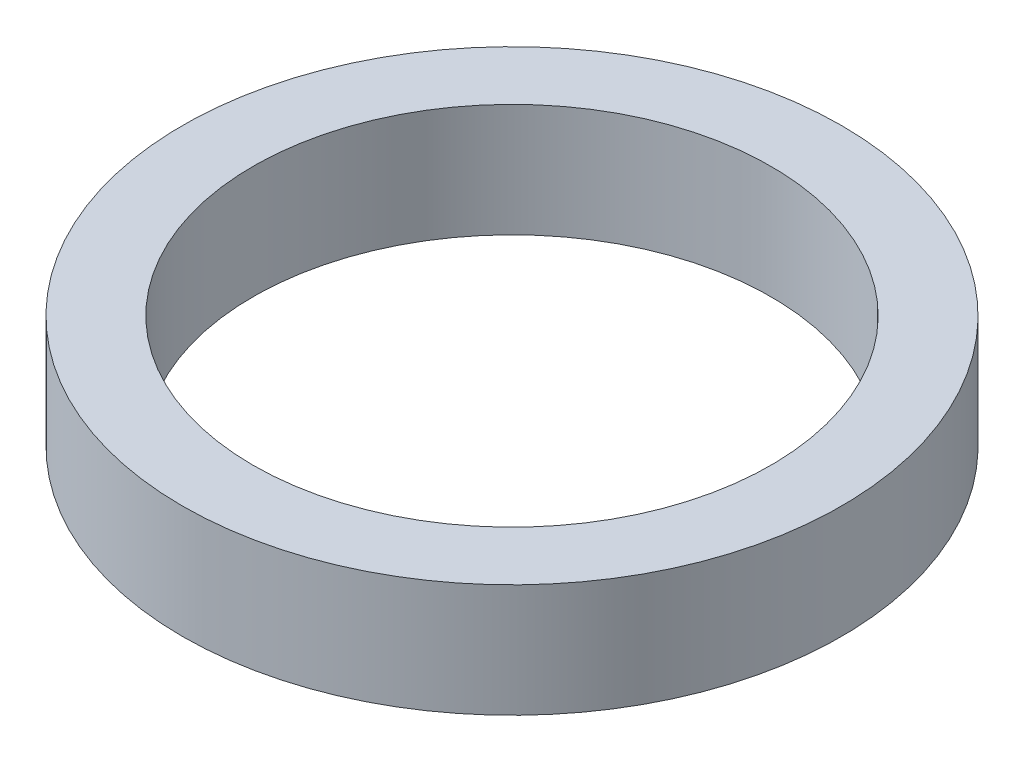
ISO-10303-21;
HEADER;
FILE_DESCRIPTION(('STEP AP214'),'2;1');
FILE_NAME('part.step','',(''),(''),'','','');
FILE_SCHEMA(('AUTOMOTIVE_DESIGN { 1 0 10303 214 1 1 1 1 }'));
ENDSEC;
DATA;
#1=APPLICATION_CONTEXT('core data for automotive mechanical design processes');
#2=APPLICATION_PROTOCOL_DEFINITION('international standard','automotive_design',2000,#1);
#3=PRODUCT_CONTEXT('',#1,'mechanical');
#4=PRODUCT('Part','Part','',(#3));
#5=PRODUCT_RELATED_PRODUCT_CATEGORY('part','',(#4));
#6=PRODUCT_DEFINITION_FORMATION('','',#4);
#7=PRODUCT_DEFINITION_CONTEXT('part definition',#1,'design');
#8=PRODUCT_DEFINITION('design','',#6,#7);
#9=PRODUCT_DEFINITION_SHAPE('','',#8);
#10=(LENGTH_UNIT() NAMED_UNIT(*) SI_UNIT(.MILLI.,.METRE.));
#11=(NAMED_UNIT(*) PLANE_ANGLE_UNIT() SI_UNIT($,.RADIAN.));
#12=(NAMED_UNIT(*) SI_UNIT($,.STERADIAN.) SOLID_ANGLE_UNIT());
#13=UNCERTAINTY_MEASURE_WITH_UNIT(LENGTH_MEASURE(1.E-05),#10,'distance_accuracy_value','');
#14=(GEOMETRIC_REPRESENTATION_CONTEXT(3) GLOBAL_UNCERTAINTY_ASSIGNED_CONTEXT((#13)) GLOBAL_UNIT_ASSIGNED_CONTEXT((#10,
#11,#12)) REPRESENTATION_CONTEXT('',''));
#15=CARTESIAN_POINT('',(0.,0.,0.));
#16=DIRECTION('',(0.,0.,1.));
#17=DIRECTION('',(1.,0.,0.));
#18=AXIS2_PLACEMENT_3D('',#15,#16,#17);
#19=CARTESIAN_POINT('',(0.,12.,0.));
#20=DIRECTION('',(0.,-1.,0.));
#21=DIRECTION('',(0.,0.,-1.));
#22=AXIS2_PLACEMENT_3D('',#19,#20,#21);
#23=CYLINDRICAL_SURFACE('',#22,35.);
#24=CARTESIAN_POINT('',(0.,12.,0.));
#25=DIRECTION('',(0.,1.,0.));
#26=DIRECTION('',(0.,0.,1.));
#27=AXIS2_PLACEMENT_3D('',#24,#25,#26);
#28=CIRCLE('',#27,35.);
#29=CARTESIAN_POINT('',(0.,12.,35.));
#30=VERTEX_POINT('',#29);
#31=EDGE_CURVE('E10',#30,#30,#28,.T.);
#32=ORIENTED_EDGE('',*,*,#31,.F.);
#33=EDGE_LOOP('',(#32));
#34=FACE_BOUND('',#33,.T.);
#35=CARTESIAN_POINT('',(0.,0.,0.));
#36=DIRECTION('',(0.,1.,0.));
#37=DIRECTION('',(0.,0.,1.));
#38=AXIS2_PLACEMENT_3D('',#35,#36,#37);
#39=CIRCLE('',#38,35.);
#40=CARTESIAN_POINT('',(0.,0.,35.));
#41=VERTEX_POINT('',#40);
#42=EDGE_CURVE('E37',#41,#41,#39,.T.);
#43=ORIENTED_EDGE('',*,*,#42,.T.);
#44=EDGE_LOOP('',(#43));
#45=FACE_BOUND('',#44,.T.);
#46=ADVANCED_FACE('F40',(#34,#45),#23,.T.);
#47=CARTESIAN_POINT('',(0.,12.,0.));
#48=DIRECTION('',(0.,1.,0.));
#49=DIRECTION('',(0.,0.,1.));
#50=AXIS2_PLACEMENT_3D('',#47,#48,#49);
#51=PLANE('',#50);
#52=CARTESIAN_POINT('',(0.,12.,0.));
#53=DIRECTION('',(0.,1.,0.));
#54=DIRECTION('',(0.,0.,1.));
#55=AXIS2_PLACEMENT_3D('',#52,#53,#54);
#56=CIRCLE('',#55,27.5);
#57=CARTESIAN_POINT('',(0.,12.,27.5));
#58=VERTEX_POINT('',#57);
#59=EDGE_CURVE('E50',#58,#58,#56,.T.);
#60=ORIENTED_EDGE('',*,*,#59,.F.);
#61=EDGE_LOOP('',(#60));
#62=FACE_BOUND('',#61,.T.);
#63=ORIENTED_EDGE('',*,*,#31,.T.);
#64=EDGE_LOOP('',(#63));
#65=FACE_BOUND('',#64,.T.);
#66=ADVANCED_FACE('F59',(#62,#65),#51,.T.);
#67=CARTESIAN_POINT('',(0.,0.,0.));
#68=DIRECTION('',(0.,1.,0.));
#69=DIRECTION('',(0.,0.,1.));
#70=AXIS2_PLACEMENT_3D('',#67,#68,#69);
#71=PLANE('',#70);
#72=CARTESIAN_POINT('',(0.,0.,0.));
#73=DIRECTION('',(0.,1.,0.));
#74=DIRECTION('',(0.,0.,1.));
#75=AXIS2_PLACEMENT_3D('',#72,#73,#74);
#76=CIRCLE('',#75,27.5);
#77=CARTESIAN_POINT('',(0.,0.,27.5));
#78=VERTEX_POINT('',#77);
#79=EDGE_CURVE('E47',#78,#78,#76,.T.);
#80=ORIENTED_EDGE('',*,*,#79,.T.);
#81=EDGE_LOOP('',(#80));
#82=FACE_BOUND('',#81,.T.);
#83=ORIENTED_EDGE('',*,*,#42,.F.);
#84=EDGE_LOOP('',(#83));
#85=FACE_BOUND('',#84,.T.);
#86=ADVANCED_FACE('F58',(#82,#85),#71,.F.);
#87=CARTESIAN_POINT('',(0.,12.,0.));
#88=DIRECTION('',(0.,-1.,0.));
#89=DIRECTION('',(0.,0.,-1.));
#90=AXIS2_PLACEMENT_3D('',#87,#88,#89);
#91=CYLINDRICAL_SURFACE('',#90,27.5);
#92=ORIENTED_EDGE('',*,*,#59,.T.);
#93=EDGE_LOOP('',(#92));
#94=FACE_BOUND('',#93,.T.);
#95=ORIENTED_EDGE('',*,*,#79,.F.);
#96=EDGE_LOOP('',(#95));
#97=FACE_BOUND('',#96,.T.);
#98=ADVANCED_FACE('F54',(#94,#97),#91,.F.);
#99=CLOSED_SHELL('',(#46,#66,#86,#98));
#100=MANIFOLD_SOLID_BREP('B2',#99);
#101=ADVANCED_BREP_SHAPE_REPRESENTATION('',(#18,#100),#14);
#102=SHAPE_DEFINITION_REPRESENTATION(#9,#101);
ENDSEC;
END-ISO-10303-21;
